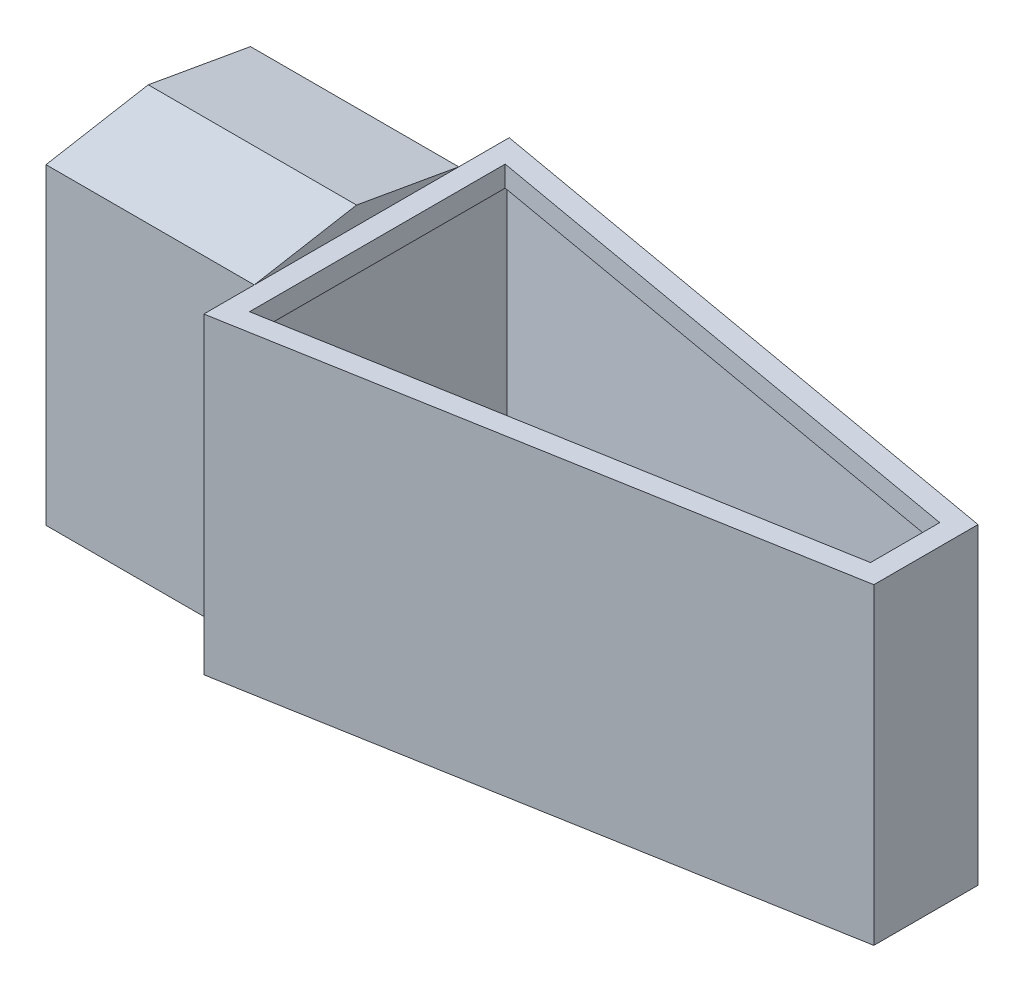
ISO-10303-21;
HEADER;
FILE_DESCRIPTION(('STEP AP214'),'2;1');
FILE_NAME('part.step','',(''),(''),'','','');
FILE_SCHEMA(('AUTOMOTIVE_DESIGN { 1 0 10303 214 1 1 1 1 }'));
ENDSEC;
DATA;
#1=APPLICATION_CONTEXT('core data for automotive mechanical design processes');
#2=APPLICATION_PROTOCOL_DEFINITION('international standard','automotive_design',2000,#1);
#3=PRODUCT_CONTEXT('',#1,'mechanical');
#4=PRODUCT('Part','Part','',(#3));
#5=PRODUCT_RELATED_PRODUCT_CATEGORY('part','',(#4));
#6=PRODUCT_DEFINITION_FORMATION('','',#4);
#7=PRODUCT_DEFINITION_CONTEXT('part definition',#1,'design');
#8=PRODUCT_DEFINITION('design','',#6,#7);
#9=PRODUCT_DEFINITION_SHAPE('','',#8);
#10=(LENGTH_UNIT() NAMED_UNIT(*) SI_UNIT(.MILLI.,.METRE.));
#11=(NAMED_UNIT(*) PLANE_ANGLE_UNIT() SI_UNIT($,.RADIAN.));
#12=(NAMED_UNIT(*) SI_UNIT($,.STERADIAN.) SOLID_ANGLE_UNIT());
#13=UNCERTAINTY_MEASURE_WITH_UNIT(LENGTH_MEASURE(1.E-05),#10,'distance_accuracy_value','');
#14=(GEOMETRIC_REPRESENTATION_CONTEXT(3) GLOBAL_UNCERTAINTY_ASSIGNED_CONTEXT((#13)) GLOBAL_UNIT_ASSIGNED_CONTEXT((#10,
#11,#12)) REPRESENTATION_CONTEXT('',''));
#15=CARTESIAN_POINT('',(0.,0.,0.));
#16=DIRECTION('',(0.,0.,1.));
#17=DIRECTION('',(1.,0.,0.));
#18=AXIS2_PLACEMENT_3D('',#15,#16,#17);
#19=CARTESIAN_POINT('',(12.8538089551144,38.1,-0.174987325087056));
#20=DIRECTION('',(1.,0.,0.));
#21=DIRECTION('',(0.,0.,-1.));
#22=AXIS2_PLACEMENT_3D('',#19,#20,#21);
#23=PLANE('',#22);
#24=DIRECTION('',(0.,-1.,0.));
#25=VECTOR('',#24,1.);
#26=CARTESIAN_POINT('',(12.8538089551144,0.,-31.26502256));
#27=LINE('',#26,#25);
#28=CARTESIAN_POINT('',(12.8538089551144,38.1,-31.26502256));
#29=VERTEX_POINT('',#28);
#30=CARTESIAN_POINT('',(12.8538089551144,0.,-31.2650225599999));
#31=VERTEX_POINT('',#30);
#32=EDGE_CURVE('E62',#29,#31,#27,.T.);
#33=ORIENTED_EDGE('',*,*,#32,.F.);
#34=DIRECTION('',(0.,0.,1.));
#35=VECTOR('',#34,1.);
#36=CARTESIAN_POINT('',(12.8538089551144,38.1,-0.174987325087056));
#37=LINE('',#36,#35);
#38=CARTESIAN_POINT('',(12.8538089551144,38.1,-37.417012674913));
#39=VERTEX_POINT('',#38);
#40=EDGE_CURVE('E395',#39,#29,#37,.T.);
#41=ORIENTED_EDGE('',*,*,#40,.F.);
#42=DIRECTION('',(0.,-1.,0.));
#43=VECTOR('',#42,1.);
#44=CARTESIAN_POINT('',(12.8538089551144,38.1,-37.417012674913));
#45=LINE('',#44,#43);
#46=CARTESIAN_POINT('',(12.8538089551144,0.,-37.417012674913));
#47=VERTEX_POINT('',#46);
#48=EDGE_CURVE('E12',#39,#47,#45,.T.);
#49=ORIENTED_EDGE('',*,*,#48,.T.);
#50=DIRECTION('',(0.,0.,1.));
#51=VECTOR('',#50,1.);
#52=CARTESIAN_POINT('',(12.8538089551144,0.,-0.174987325087056));
#53=LINE('',#52,#51);
#54=EDGE_CURVE('E407',#47,#31,#53,.T.);
#55=ORIENTED_EDGE('',*,*,#54,.T.);
#56=EDGE_LOOP('',(#33,#41,#49,#55));
#57=FACE_BOUND('',#56,.T.);
#58=ADVANCED_FACE('F39',(#57),#23,.F.);
#59=DIRECTION('',(0.,1.,0.));
#60=VECTOR('',#59,1.);
#61=CARTESIAN_POINT('',(12.8538089551144,0.,-6.32697744));
#62=LINE('',#61,#60);
#63=CARTESIAN_POINT('',(12.8538089551144,0.,-6.32697744));
#64=VERTEX_POINT('',#63);
#65=CARTESIAN_POINT('',(12.8538089551144,38.1,-6.32697744));
#66=VERTEX_POINT('',#65);
#67=EDGE_CURVE('E306',#64,#66,#62,.T.);
#68=ORIENTED_EDGE('',*,*,#67,.F.);
#69=CARTESIAN_POINT('',(12.8538089551144,0.,-0.174987325087056));
#70=VERTEX_POINT('',#69);
#71=EDGE_CURVE('E406',#64,#70,#53,.T.);
#72=ORIENTED_EDGE('',*,*,#71,.T.);
#73=DIRECTION('',(0.,-1.,0.));
#74=VECTOR('',#73,1.);
#75=CARTESIAN_POINT('',(12.8538089551144,38.1,-0.174987325087056));
#76=LINE('',#75,#74);
#77=CARTESIAN_POINT('',(12.8538089551144,38.1,-0.174987325087056));
#78=VERTEX_POINT('',#77);
#79=EDGE_CURVE('E47',#78,#70,#76,.T.);
#80=ORIENTED_EDGE('',*,*,#79,.F.);
#81=EDGE_CURVE('E393',#66,#78,#37,.T.);
#82=ORIENTED_EDGE('',*,*,#81,.F.);
#83=EDGE_LOOP('',(#68,#72,#80,#82));
#84=FACE_BOUND('',#83,.T.);
#85=ADVANCED_FACE('F446',(#84),#23,.F.);
#86=CARTESIAN_POINT('',(0.,38.1,0.));
#87=DIRECTION('',(0.,-1.,0.));
#88=DIRECTION('',(0.,0.,-1.));
#89=AXIS2_PLACEMENT_3D('',#86,#87,#88);
#90=PLANE('',#89);
#91=DIRECTION('',(-0.984743468318978,0.,-0.174012360489451));
#92=VECTOR('',#91,1.);
#93=CARTESIAN_POINT('',(82.2959999999999,38.1,-25.146));
#94=LINE('',#93,#92);
#95=CARTESIAN_POINT('',(82.2959999999999,38.1,-25.146));
#96=VERTEX_POINT('',#95);
#97=EDGE_CURVE('E390',#96,#39,#94,.T.);
#98=ORIENTED_EDGE('',*,*,#97,.T.);
#99=ORIENTED_EDGE('',*,*,#40,.T.);
#100=EDGE_CURVE('E399',#29,#66,#37,.T.);
#101=ORIENTED_EDGE('',*,*,#100,.T.);
#102=ORIENTED_EDGE('',*,*,#81,.T.);
#103=DIRECTION('',(0.984743468318978,0.,-0.17401236048945));
#104=VECTOR('',#103,1.);
#105=CARTESIAN_POINT('',(82.2959999999999,38.1,-12.446));
#106=LINE('',#105,#104);
#107=CARTESIAN_POINT('',(82.2959999999999,38.1,-12.446));
#108=VERTEX_POINT('',#107);
#109=EDGE_CURVE('E398',#78,#108,#106,.T.);
#110=ORIENTED_EDGE('',*,*,#109,.T.);
#111=DIRECTION('',(0.,0.,-1.));
#112=VECTOR('',#111,1.);
#113=CARTESIAN_POINT('',(82.2959999999999,38.1,-12.446));
#114=LINE('',#113,#112);
#115=EDGE_CURVE('E401',#108,#96,#114,.T.);
#116=ORIENTED_EDGE('',*,*,#115,.T.);
#117=EDGE_LOOP('',(#98,#99,#101,#102,#110,#116));
#118=FACE_BOUND('',#117,.T.);
#119=DIRECTION('',(0.,0.,-1.));
#120=VECTOR('',#119,1.);
#121=CARTESIAN_POINT('',(15.3938089551144,38.1,-34.3888215859853));
#122=LINE('',#121,#120);
#123=CARTESIAN_POINT('',(15.3938089551144,38.1,-3.20317841401467));
#124=VERTEX_POINT('',#123);
#125=CARTESIAN_POINT('',(15.3938089551144,38.1,-34.3888215859853));
#126=VERTEX_POINT('',#125);
#127=EDGE_CURVE('E362',#124,#126,#122,.T.);
#128=ORIENTED_EDGE('',*,*,#127,.T.);
#129=DIRECTION('',(0.984743468318978,0.,0.174012360489451));
#130=VECTOR('',#129,1.);
#131=CARTESIAN_POINT('',(79.7559999999999,38.1,-23.0154871589875));
#132=LINE('',#131,#130);
#133=CARTESIAN_POINT('',(79.7559999999999,38.1,-23.0154871589875));
#134=VERTEX_POINT('',#133);
#135=EDGE_CURVE('E358',#126,#134,#132,.T.);
#136=ORIENTED_EDGE('',*,*,#135,.T.);
#137=DIRECTION('',(0.,0.,1.));
#138=VECTOR('',#137,1.);
#139=CARTESIAN_POINT('',(79.7559999999999,38.1,-14.5765128410125));
#140=LINE('',#139,#138);
#141=CARTESIAN_POINT('',(79.7559999999999,38.1,-14.5765128410125));
#142=VERTEX_POINT('',#141);
#143=EDGE_CURVE('E361',#134,#142,#140,.T.);
#144=ORIENTED_EDGE('',*,*,#143,.T.);
#145=DIRECTION('',(-0.984743468318978,0.,0.17401236048945));
#146=VECTOR('',#145,1.);
#147=CARTESIAN_POINT('',(15.3938089551144,38.1,-3.20317841401467));
#148=LINE('',#147,#146);
#149=EDGE_CURVE('E365',#142,#124,#148,.T.);
#150=ORIENTED_EDGE('',*,*,#149,.T.);
#151=EDGE_LOOP('',(#128,#136,#144,#150));
#152=FACE_BOUND('',#151,.T.);
#153=ADVANCED_FACE('F442',(#118,#152),#90,.F.);
#154=CARTESIAN_POINT('',(82.2959999999999,38.1,-25.146));
#155=DIRECTION('',(-0.174012360489451,0.,0.984743468318978));
#156=DIRECTION('',(0.984743468318978,0.,0.174012360489451));
#157=AXIS2_PLACEMENT_3D('',#154,#155,#156);
#158=PLANE('',#157);
#159=DIRECTION('',(-0.984743468318978,0.,-0.174012360489451));
#160=VECTOR('',#159,1.);
#161=CARTESIAN_POINT('',(82.2959999999999,0.,-25.146));
#162=LINE('',#161,#160);
#163=CARTESIAN_POINT('',(82.2959999999999,0.,-25.146));
#164=VERTEX_POINT('',#163);
#165=EDGE_CURVE('E368',#164,#47,#162,.T.);
#166=ORIENTED_EDGE('',*,*,#165,.T.);
#167=ORIENTED_EDGE('',*,*,#48,.F.);
#168=ORIENTED_EDGE('',*,*,#97,.F.);
#169=DIRECTION('',(0.,-1.,0.));
#170=VECTOR('',#169,1.);
#171=CARTESIAN_POINT('',(82.2959999999999,38.1,-25.146));
#172=LINE('',#171,#170);
#173=EDGE_CURVE('E403',#96,#164,#172,.T.);
#174=ORIENTED_EDGE('',*,*,#173,.T.);
#175=EDGE_LOOP('',(#166,#167,#168,#174));
#176=FACE_BOUND('',#175,.T.);
#177=ADVANCED_FACE('F41',(#176),#158,.F.);
#178=EDGE_CURVE('E411',#31,#64,#53,.T.);
#179=ORIENTED_EDGE('',*,*,#178,.T.);
#180=DIRECTION('',(0.,0.173648177666934,-0.984807753012208));
#181=VECTOR('',#180,1.);
#182=CARTESIAN_POINT('',(12.8538089551144,-1.08197686542356,-0.19078171387655));
#183=LINE('',#182,#181);
#184=CARTESIAN_POINT('',(12.8538089551144,2.19862510039056,-18.7959999999999));
#185=VERTEX_POINT('',#184);
#186=EDGE_CURVE('E303',#64,#185,#183,.T.);
#187=ORIENTED_EDGE('',*,*,#186,.T.);
#188=DIRECTION('',(0.,-0.173648177666931,-0.984807753012208));
#189=VECTOR('',#188,1.);
#190=CARTESIAN_POINT('',(12.8538089551144,5.34663374852575,-0.942755785831534));
#191=LINE('',#190,#189);
#192=EDGE_CURVE('E300',#185,#31,#191,.T.);
#193=ORIENTED_EDGE('',*,*,#192,.T.);
#194=EDGE_LOOP('',(#179,#187,#193));
#195=FACE_BOUND('',#194,.T.);
#196=ADVANCED_FACE('F468',(#195),#23,.F.);
#197=CARTESIAN_POINT('',(82.2959999999999,38.1,-12.446));
#198=DIRECTION('',(-0.17401236048945,0.,-0.984743468318978));
#199=DIRECTION('',(-0.984743468318978,0.,0.17401236048945));
#200=AXIS2_PLACEMENT_3D('',#197,#198,#199);
#201=PLANE('',#200);
#202=DIRECTION('',(0.984743468318978,0.,-0.17401236048945));
#203=VECTOR('',#202,1.);
#204=CARTESIAN_POINT('',(82.2959999999999,0.,-12.446));
#205=LINE('',#204,#203);
#206=CARTESIAN_POINT('',(82.2959999999999,0.,-12.446));
#207=VERTEX_POINT('',#206);
#208=EDGE_CURVE('E410',#70,#207,#205,.T.);
#209=ORIENTED_EDGE('',*,*,#208,.T.);
#210=DIRECTION('',(0.,-1.,0.));
#211=VECTOR('',#210,1.);
#212=CARTESIAN_POINT('',(82.2959999999999,38.1,-12.446));
#213=LINE('',#212,#211);
#214=EDGE_CURVE('E416',#108,#207,#213,.T.);
#215=ORIENTED_EDGE('',*,*,#214,.F.);
#216=ORIENTED_EDGE('',*,*,#109,.F.);
#217=ORIENTED_EDGE('',*,*,#79,.T.);
#218=EDGE_LOOP('',(#209,#215,#216,#217));
#219=FACE_BOUND('',#218,.T.);
#220=ADVANCED_FACE('F423',(#219),#201,.F.);
#221=CARTESIAN_POINT('',(82.2959999999999,38.1,-12.446));
#222=DIRECTION('',(-1.,0.,0.));
#223=DIRECTION('',(0.,0.,1.));
#224=AXIS2_PLACEMENT_3D('',#221,#222,#223);
#225=PLANE('',#224);
#226=DIRECTION('',(0.,0.,-1.));
#227=VECTOR('',#226,1.);
#228=CARTESIAN_POINT('',(82.2959999999999,0.,-12.446));
#229=LINE('',#228,#227);
#230=EDGE_CURVE('E394',#207,#164,#229,.T.);
#231=ORIENTED_EDGE('',*,*,#230,.T.);
#232=ORIENTED_EDGE('',*,*,#173,.F.);
#233=ORIENTED_EDGE('',*,*,#115,.F.);
#234=ORIENTED_EDGE('',*,*,#214,.T.);
#235=EDGE_LOOP('',(#231,#232,#233,#234));
#236=FACE_BOUND('',#235,.T.);
#237=ADVANCED_FACE('F436',(#236),#225,.F.);
#238=CARTESIAN_POINT('',(0.,0.,0.));
#239=DIRECTION('',(0.,-1.,0.));
#240=DIRECTION('',(0.,0.,-1.));
#241=AXIS2_PLACEMENT_3D('',#238,#239,#240);
#242=PLANE('',#241);
#243=ORIENTED_EDGE('',*,*,#165,.F.);
#244=ORIENTED_EDGE('',*,*,#230,.F.);
#245=ORIENTED_EDGE('',*,*,#208,.F.);
#246=ORIENTED_EDGE('',*,*,#71,.F.);
#247=ORIENTED_EDGE('',*,*,#178,.F.);
#248=ORIENTED_EDGE('',*,*,#54,.F.);
#249=EDGE_LOOP('',(#243,#244,#245,#246,#247,#248));
#250=FACE_BOUND('',#249,.T.);
#251=ADVANCED_FACE('F431',(#250),#242,.T.);
#252=CARTESIAN_POINT('',(15.3938089551144,109.619479697127,-34.3888215859853));
#253=DIRECTION('',(1.,0.,0.));
#254=DIRECTION('',(0.,0.,-1.));
#255=AXIS2_PLACEMENT_3D('',#252,#253,#254);
#256=PLANE('',#255);
#257=DIRECTION('',(0.,-1.,0.));
#258=VECTOR('',#257,1.);
#259=CARTESIAN_POINT('',(15.3938089551144,109.619479697127,-3.20317841401467));
#260=LINE('',#259,#258);
#261=CARTESIAN_POINT('',(15.3938089551144,35.56,-3.20317841401467));
#262=VERTEX_POINT('',#261);
#263=EDGE_CURVE('E376',#124,#262,#260,.T.);
#264=ORIENTED_EDGE('',*,*,#263,.T.);
#265=DIRECTION('',(0.,0.,1.));
#266=VECTOR('',#265,1.);
#267=CARTESIAN_POINT('',(15.3938089551144,35.56,-34.3888215859853));
#268=LINE('',#267,#266);
#269=CARTESIAN_POINT('',(15.3938089551144,35.56,-34.3888215859853));
#270=VERTEX_POINT('',#269);
#271=EDGE_CURVE('E374',#270,#262,#268,.T.);
#272=ORIENTED_EDGE('',*,*,#271,.F.);
#273=DIRECTION('',(0.,-1.,0.));
#274=VECTOR('',#273,1.);
#275=CARTESIAN_POINT('',(15.3938089551144,109.619479697127,-34.3888215859853));
#276=LINE('',#275,#274);
#277=EDGE_CURVE('E379',#126,#270,#276,.T.);
#278=ORIENTED_EDGE('',*,*,#277,.F.);
#279=ORIENTED_EDGE('',*,*,#127,.F.);
#280=EDGE_LOOP('',(#264,#272,#278,#279));
#281=FACE_BOUND('',#280,.T.);
#282=ADVANCED_FACE('F509',(#281),#256,.T.);
#283=CARTESIAN_POINT('',(79.7559999999999,109.619479697127,-23.0154871589875));
#284=DIRECTION('',(-0.174012360489451,0.,0.984743468318978));
#285=DIRECTION('',(0.984743468318978,0.,0.174012360489451));
#286=AXIS2_PLACEMENT_3D('',#283,#284,#285);
#287=PLANE('',#286);
#288=ORIENTED_EDGE('',*,*,#277,.T.);
#289=DIRECTION('',(-0.984743468318978,0.,-0.174012360489451));
#290=VECTOR('',#289,1.);
#291=CARTESIAN_POINT('',(79.7559999999999,35.56,-23.0154871589875));
#292=LINE('',#291,#290);
#293=CARTESIAN_POINT('',(79.7559999999999,35.56,-23.0154871589875));
#294=VERTEX_POINT('',#293);
#295=EDGE_CURVE('E372',#294,#270,#292,.T.);
#296=ORIENTED_EDGE('',*,*,#295,.F.);
#297=DIRECTION('',(0.,-1.,0.));
#298=VECTOR('',#297,1.);
#299=CARTESIAN_POINT('',(79.7559999999999,109.619479697127,-23.0154871589875));
#300=LINE('',#299,#298);
#301=EDGE_CURVE('E382',#134,#294,#300,.T.);
#302=ORIENTED_EDGE('',*,*,#301,.F.);
#303=ORIENTED_EDGE('',*,*,#135,.F.);
#304=EDGE_LOOP('',(#288,#296,#302,#303));
#305=FACE_BOUND('',#304,.T.);
#306=ADVANCED_FACE('F529',(#305),#287,.T.);
#307=CARTESIAN_POINT('',(79.7559999999999,109.619479697127,-14.5765128410125));
#308=DIRECTION('',(-1.,0.,0.));
#309=DIRECTION('',(0.,0.,1.));
#310=AXIS2_PLACEMENT_3D('',#307,#308,#309);
#311=PLANE('',#310);
#312=ORIENTED_EDGE('',*,*,#301,.T.);
#313=DIRECTION('',(0.,0.,-1.));
#314=VECTOR('',#313,1.);
#315=CARTESIAN_POINT('',(79.7559999999999,35.56,-14.5765128410125));
#316=LINE('',#315,#314);
#317=CARTESIAN_POINT('',(79.7559999999999,35.56,-14.5765128410125));
#318=VERTEX_POINT('',#317);
#319=EDGE_CURVE('E370',#318,#294,#316,.T.);
#320=ORIENTED_EDGE('',*,*,#319,.F.);
#321=DIRECTION('',(0.,-1.,0.));
#322=VECTOR('',#321,1.);
#323=CARTESIAN_POINT('',(79.7559999999999,109.619479697127,-14.5765128410125));
#324=LINE('',#323,#322);
#325=EDGE_CURVE('E385',#142,#318,#324,.T.);
#326=ORIENTED_EDGE('',*,*,#325,.F.);
#327=ORIENTED_EDGE('',*,*,#143,.F.);
#328=EDGE_LOOP('',(#312,#320,#326,#327));
#329=FACE_BOUND('',#328,.T.);
#330=ADVANCED_FACE('F537',(#329),#311,.T.);
#331=CARTESIAN_POINT('',(15.3938089551144,109.619479697127,-3.20317841401467));
#332=DIRECTION('',(-0.17401236048945,0.,-0.984743468318978));
#333=DIRECTION('',(-0.984743468318978,0.,0.17401236048945));
#334=AXIS2_PLACEMENT_3D('',#331,#332,#333);
#335=PLANE('',#334);
#336=ORIENTED_EDGE('',*,*,#325,.T.);
#337=DIRECTION('',(0.984743468318978,0.,-0.17401236048945));
#338=VECTOR('',#337,1.);
#339=CARTESIAN_POINT('',(15.3938089551144,35.56,-3.20317841401467));
#340=LINE('',#339,#338);
#341=EDGE_CURVE('E357',#262,#318,#340,.T.);
#342=ORIENTED_EDGE('',*,*,#341,.F.);
#343=ORIENTED_EDGE('',*,*,#263,.F.);
#344=ORIENTED_EDGE('',*,*,#149,.F.);
#345=EDGE_LOOP('',(#336,#342,#343,#344));
#346=FACE_BOUND('',#345,.T.);
#347=ADVANCED_FACE('F506',(#346),#335,.T.);
#348=CARTESIAN_POINT('',(0.,1.27,0.));
#349=DIRECTION('',(0.,-1.,0.));
#350=DIRECTION('',(0.,0.,-1.));
#351=AXIS2_PLACEMENT_3D('',#348,#349,#350);
#352=PLANE('',#351);
#353=DIRECTION('',(0.984743468318978,0.,-0.17401236048945));
#354=VECTOR('',#353,1.);
#355=CARTESIAN_POINT('',(14.1238089551144,1.26999999999999,-1.68908286955086));
#356=LINE('',#355,#354);
#357=CARTESIAN_POINT('',(14.1238089551144,1.26999999999998,-1.68908286955086));
#358=VERTEX_POINT('',#357);
#359=CARTESIAN_POINT('',(81.0259999999999,1.26999999999998,-13.5112564205063));
#360=VERTEX_POINT('',#359);
#361=EDGE_CURVE('E341',#358,#360,#356,.T.);
#362=ORIENTED_EDGE('',*,*,#361,.T.);
#363=DIRECTION('',(0.,0.,-1.));
#364=VECTOR('',#363,1.);
#365=CARTESIAN_POINT('',(81.0259999999999,1.26999999999998,-13.5112564205063));
#366=LINE('',#365,#364);
#367=CARTESIAN_POINT('',(81.0259999999999,1.26999999999995,-24.0807435794937));
#368=VERTEX_POINT('',#367);
#369=EDGE_CURVE('E329',#360,#368,#366,.T.);
#370=ORIENTED_EDGE('',*,*,#369,.T.);
#371=DIRECTION('',(-0.984743468318978,0.,-0.174012360489451));
#372=VECTOR('',#371,1.);
#373=CARTESIAN_POINT('',(81.0259999999999,1.26999999999998,-24.0807435794937));
#374=LINE('',#373,#372);
#375=CARTESIAN_POINT('',(14.1238089551144,1.26999999999998,-35.9029171304491));
#376=VERTEX_POINT('',#375);
#377=EDGE_CURVE('E350',#368,#376,#374,.T.);
#378=ORIENTED_EDGE('',*,*,#377,.T.);
#379=DIRECTION('',(0.,0.,1.));
#380=VECTOR('',#379,1.);
#381=CARTESIAN_POINT('',(14.1238089551144,1.26999999999998,-35.9029171304491));
#382=LINE('',#381,#380);
#383=EDGE_CURVE('E346',#376,#358,#382,.T.);
#384=ORIENTED_EDGE('',*,*,#383,.T.);
#385=EDGE_LOOP('',(#362,#370,#378,#384));
#386=FACE_BOUND('',#385,.T.);
#387=ADVANCED_FACE('F551',(#386),#352,.F.);
#388=CARTESIAN_POINT('',(0.,35.56,0.));
#389=DIRECTION('',(0.,1.,0.));
#390=DIRECTION('',(0.,0.,1.));
#391=AXIS2_PLACEMENT_3D('',#388,#389,#390);
#392=PLANE('',#391);
#393=ORIENTED_EDGE('',*,*,#341,.T.);
#394=ORIENTED_EDGE('',*,*,#319,.T.);
#395=ORIENTED_EDGE('',*,*,#295,.T.);
#396=ORIENTED_EDGE('',*,*,#271,.T.);
#397=EDGE_LOOP('',(#393,#394,#395,#396));
#398=FACE_BOUND('',#397,.T.);
#399=DIRECTION('',(0.984743468318978,0.,-0.17401236048945));
#400=VECTOR('',#399,1.);
#401=CARTESIAN_POINT('',(14.1238089551144,35.56,-1.68908286955086));
#402=LINE('',#401,#400);
#403=CARTESIAN_POINT('',(14.1238089551144,35.56,-1.68908286955086));
#404=VERTEX_POINT('',#403);
#405=CARTESIAN_POINT('',(81.0259999999999,35.56,-13.5112564205063));
#406=VERTEX_POINT('',#405);
#407=EDGE_CURVE('E325',#404,#406,#402,.T.);
#408=ORIENTED_EDGE('',*,*,#407,.F.);
#409=DIRECTION('',(0.,0.,1.));
#410=VECTOR('',#409,1.);
#411=CARTESIAN_POINT('',(14.1238089551144,35.56,-35.9029171304491));
#412=LINE('',#411,#410);
#413=CARTESIAN_POINT('',(14.1238089551144,35.56,-35.9029171304491));
#414=VERTEX_POINT('',#413);
#415=EDGE_CURVE('E326',#414,#404,#412,.T.);
#416=ORIENTED_EDGE('',*,*,#415,.F.);
#417=DIRECTION('',(-0.984743468318978,0.,-0.174012360489451));
#418=VECTOR('',#417,1.);
#419=CARTESIAN_POINT('',(81.0259999999999,35.56,-24.0807435794937));
#420=LINE('',#419,#418);
#421=CARTESIAN_POINT('',(81.0259999999999,35.56,-24.0807435794937));
#422=VERTEX_POINT('',#421);
#423=EDGE_CURVE('E330',#422,#414,#420,.T.);
#424=ORIENTED_EDGE('',*,*,#423,.F.);
#425=DIRECTION('',(0.,0.,-1.));
#426=VECTOR('',#425,1.);
#427=CARTESIAN_POINT('',(81.0259999999999,35.56,-13.5112564205063));
#428=LINE('',#427,#426);
#429=EDGE_CURVE('E333',#406,#422,#428,.T.);
#430=ORIENTED_EDGE('',*,*,#429,.F.);
#431=EDGE_LOOP('',(#408,#416,#424,#430));
#432=FACE_BOUND('',#431,.T.);
#433=ADVANCED_FACE('F558',(#398,#432),#392,.F.);
#434=CARTESIAN_POINT('',(81.0259999999999,-75.1431275729097,-13.5112564205063));
#435=DIRECTION('',(1.,0.,0.));
#436=DIRECTION('',(0.,0.,-1.));
#437=AXIS2_PLACEMENT_3D('',#434,#435,#436);
#438=PLANE('',#437);
#439=DIRECTION('',(0.,1.,0.));
#440=VECTOR('',#439,1.);
#441=CARTESIAN_POINT('',(81.0259999999999,-75.1431275729097,-13.5112564205063));
#442=LINE('',#441,#440);
#443=EDGE_CURVE('E344',#360,#406,#442,.T.);
#444=ORIENTED_EDGE('',*,*,#443,.T.);
#445=ORIENTED_EDGE('',*,*,#429,.T.);
#446=DIRECTION('',(0.,1.,0.));
#447=VECTOR('',#446,1.);
#448=CARTESIAN_POINT('',(81.0259999999999,-75.1431275729097,-24.0807435794937));
#449=LINE('',#448,#447);
#450=EDGE_CURVE('E340',#368,#422,#449,.T.);
#451=ORIENTED_EDGE('',*,*,#450,.F.);
#452=ORIENTED_EDGE('',*,*,#369,.F.);
#453=EDGE_LOOP('',(#444,#445,#451,#452));
#454=FACE_BOUND('',#453,.T.);
#455=ADVANCED_FACE('F566',(#454),#438,.F.);
#456=CARTESIAN_POINT('',(81.0259999999999,-75.1431275729097,-24.0807435794937));
#457=DIRECTION('',(0.174012360489451,0.,-0.984743468318978));
#458=DIRECTION('',(-0.984743468318978,0.,-0.174012360489451));
#459=AXIS2_PLACEMENT_3D('',#456,#457,#458);
#460=PLANE('',#459);
#461=ORIENTED_EDGE('',*,*,#450,.T.);
#462=ORIENTED_EDGE('',*,*,#423,.T.);
#463=DIRECTION('',(0.,1.,0.));
#464=VECTOR('',#463,1.);
#465=CARTESIAN_POINT('',(14.1238089551144,-75.1431275729097,-35.9029171304491));
#466=LINE('',#465,#464);
#467=EDGE_CURVE('E349',#376,#414,#466,.T.);
#468=ORIENTED_EDGE('',*,*,#467,.F.);
#469=ORIENTED_EDGE('',*,*,#377,.F.);
#470=EDGE_LOOP('',(#461,#462,#468,#469));
#471=FACE_BOUND('',#470,.T.);
#472=ADVANCED_FACE('F574',(#471),#460,.F.);
#473=CARTESIAN_POINT('',(14.1238089551144,-75.1431275729097,-35.9029171304491));
#474=DIRECTION('',(-1.,0.,0.));
#475=DIRECTION('',(0.,0.,1.));
#476=AXIS2_PLACEMENT_3D('',#473,#474,#475);
#477=PLANE('',#476);
#478=ORIENTED_EDGE('',*,*,#467,.T.);
#479=ORIENTED_EDGE('',*,*,#415,.T.);
#480=DIRECTION('',(0.,1.,0.));
#481=VECTOR('',#480,1.);
#482=CARTESIAN_POINT('',(14.1238089551144,-75.1431275729097,-1.68908286955086));
#483=LINE('',#482,#481);
#484=EDGE_CURVE('E345',#358,#404,#483,.T.);
#485=ORIENTED_EDGE('',*,*,#484,.F.);
#486=ORIENTED_EDGE('',*,*,#383,.F.);
#487=EDGE_LOOP('',(#478,#479,#485,#486));
#488=FACE_BOUND('',#487,.T.);
#489=ADVANCED_FACE('F582',(#488),#477,.F.);
#490=CARTESIAN_POINT('',(14.1238089551144,-75.1431275729097,-1.68908286955086));
#491=DIRECTION('',(0.17401236048945,0.,0.984743468318978));
#492=DIRECTION('',(0.984743468318978,0.,-0.17401236048945));
#493=AXIS2_PLACEMENT_3D('',#490,#491,#492);
#494=PLANE('',#493);
#495=ORIENTED_EDGE('',*,*,#484,.T.);
#496=ORIENTED_EDGE('',*,*,#407,.T.);
#497=ORIENTED_EDGE('',*,*,#443,.F.);
#498=ORIENTED_EDGE('',*,*,#361,.F.);
#499=EDGE_LOOP('',(#495,#496,#497,#498));
#500=FACE_BOUND('',#499,.T.);
#501=ADVANCED_FACE('F590',(#500),#494,.F.);
#502=CARTESIAN_POINT('',(-12.5461910448856,0.,-31.26502256));
#503=DIRECTION('',(0.,0.,1.));
#504=DIRECTION('',(0.,-1.,0.));
#505=AXIS2_PLACEMENT_3D('',#502,#503,#504);
#506=PLANE('',#505);
#507=ORIENTED_EDGE('',*,*,#32,.T.);
#508=DIRECTION('',(1.,0.,0.));
#509=VECTOR('',#508,1.);
#510=CARTESIAN_POINT('',(-12.5461910448856,0.,-31.26502256));
#511=LINE('',#510,#509);
#512=CARTESIAN_POINT('',(-12.5461910448856,0.,-31.26502256));
#513=VERTEX_POINT('',#512);
#514=EDGE_CURVE('E323',#513,#31,#511,.T.);
#515=ORIENTED_EDGE('',*,*,#514,.F.);
#516=DIRECTION('',(0.,-1.,0.));
#517=VECTOR('',#516,1.);
#518=CARTESIAN_POINT('',(-12.5461910448856,0.,-31.26502256));
#519=LINE('',#518,#517);
#520=CARTESIAN_POINT('',(-12.5461910448856,38.1,-31.26502256));
#521=VERTEX_POINT('',#520);
#522=EDGE_CURVE('E283',#521,#513,#519,.T.);
#523=ORIENTED_EDGE('',*,*,#522,.F.);
#524=DIRECTION('',(1.,0.,0.));
#525=VECTOR('',#524,1.);
#526=CARTESIAN_POINT('',(-12.5461910448856,38.1,-31.26502256));
#527=LINE('',#526,#525);
#528=EDGE_CURVE('E298',#521,#29,#527,.T.);
#529=ORIENTED_EDGE('',*,*,#528,.T.);
#530=EDGE_LOOP('',(#507,#515,#523,#529));
#531=FACE_BOUND('',#530,.T.);
#532=ADVANCED_FACE('F465',(#531),#506,.F.);
#533=CARTESIAN_POINT('',(-12.5461910448856,5.34663374852575,-0.942755785831534));
#534=DIRECTION('',(0.,-0.984807753012208,0.173648177666931));
#535=DIRECTION('',(0.,-0.173648177666931,-0.984807753012208));
#536=AXIS2_PLACEMENT_3D('',#533,#534,#535);
#537=PLANE('',#536);
#538=ORIENTED_EDGE('',*,*,#192,.F.);
#539=DIRECTION('',(1.,0.,0.));
#540=VECTOR('',#539,1.);
#541=CARTESIAN_POINT('',(-12.5461910448856,2.19862510039056,-18.7959999999999));
#542=LINE('',#541,#540);
#543=CARTESIAN_POINT('',(-12.5461910448856,2.19862510039056,-18.7959999999999));
#544=VERTEX_POINT('',#543);
#545=EDGE_CURVE('E321',#544,#185,#542,.T.);
#546=ORIENTED_EDGE('',*,*,#545,.F.);
#547=DIRECTION('',(0.,-0.173648177666931,-0.984807753012208));
#548=VECTOR('',#547,1.);
#549=CARTESIAN_POINT('',(-12.5461910448856,5.34663374852575,-0.942755785831534));
#550=LINE('',#549,#548);
#551=EDGE_CURVE('E285',#544,#513,#550,.T.);
#552=ORIENTED_EDGE('',*,*,#551,.T.);
#553=ORIENTED_EDGE('',*,*,#514,.T.);
#554=EDGE_LOOP('',(#538,#546,#552,#553));
#555=FACE_BOUND('',#554,.T.);
#556=ADVANCED_FACE('F471',(#555),#537,.T.);
#557=CARTESIAN_POINT('',(-12.5461910448856,-1.08197686542356,-0.19078171387655));
#558=DIRECTION('',(0.,-0.984807753012207,-0.173648177666934));
#559=DIRECTION('',(0.,0.173648177666934,-0.984807753012207));
#560=AXIS2_PLACEMENT_3D('',#557,#558,#559);
#561=PLANE('',#560);
#562=ORIENTED_EDGE('',*,*,#186,.F.);
#563=DIRECTION('',(1.,0.,0.));
#564=VECTOR('',#563,1.);
#565=CARTESIAN_POINT('',(-12.5461910448856,0.,-6.32697744));
#566=LINE('',#565,#564);
#567=CARTESIAN_POINT('',(-12.5461910448856,0.,-6.32697744));
#568=VERTEX_POINT('',#567);
#569=EDGE_CURVE('E319',#568,#64,#566,.T.);
#570=ORIENTED_EDGE('',*,*,#569,.F.);
#571=DIRECTION('',(0.,0.173648177666934,-0.984807753012208));
#572=VECTOR('',#571,1.);
#573=CARTESIAN_POINT('',(-12.5461910448856,-1.08197686542356,-0.19078171387655));
#574=LINE('',#573,#572);
#575=EDGE_CURVE('E289',#568,#544,#574,.T.);
#576=ORIENTED_EDGE('',*,*,#575,.T.);
#577=ORIENTED_EDGE('',*,*,#545,.T.);
#578=EDGE_LOOP('',(#562,#570,#576,#577));
#579=FACE_BOUND('',#578,.T.);
#580=ADVANCED_FACE('F477',(#579),#561,.T.);
#581=CARTESIAN_POINT('',(-12.5461910448856,0.,-6.32697744));
#582=DIRECTION('',(0.,0.,-1.));
#583=DIRECTION('',(0.,1.,0.));
#584=AXIS2_PLACEMENT_3D('',#581,#582,#583);
#585=PLANE('',#584);
#586=ORIENTED_EDGE('',*,*,#67,.T.);
#587=DIRECTION('',(1.,0.,0.));
#588=VECTOR('',#587,1.);
#589=CARTESIAN_POINT('',(-12.5461910448856,38.1,-6.32697744));
#590=LINE('',#589,#588);
#591=CARTESIAN_POINT('',(-12.5461910448856,38.1,-6.32697744));
#592=VERTEX_POINT('',#591);
#593=EDGE_CURVE('E316',#592,#66,#590,.T.);
#594=ORIENTED_EDGE('',*,*,#593,.F.);
#595=DIRECTION('',(0.,1.,0.));
#596=VECTOR('',#595,1.);
#597=CARTESIAN_POINT('',(-12.5461910448856,0.,-6.32697744));
#598=LINE('',#597,#596);
#599=EDGE_CURVE('E292',#568,#592,#598,.T.);
#600=ORIENTED_EDGE('',*,*,#599,.F.);
#601=ORIENTED_EDGE('',*,*,#569,.T.);
#602=EDGE_LOOP('',(#586,#594,#600,#601));
#603=FACE_BOUND('',#602,.T.);
#604=ADVANCED_FACE('F449',(#603),#585,.F.);
#605=CARTESIAN_POINT('',(-12.5461910448856,35.8691675605479,6.32470201647762));
#606=DIRECTION('',(0.,-0.984807753012207,-0.173648177666935));
#607=DIRECTION('',(0.,0.173648177666935,-0.984807753012207));
#608=AXIS2_PLACEMENT_3D('',#605,#606,#607);
#609=PLANE('',#608);
#610=DIRECTION('',(0.,0.173648177666935,-0.984807753012207));
#611=VECTOR('',#610,1.);
#612=CARTESIAN_POINT('',(12.8538089551144,35.8691675605479,6.32470201647762));
#613=LINE('',#612,#611);
#614=CARTESIAN_POINT('',(12.8538089551144,40.2986251003906,-18.7959999999999));
#615=VERTEX_POINT('',#614);
#616=EDGE_CURVE('E308',#66,#615,#613,.T.);
#617=ORIENTED_EDGE('',*,*,#616,.T.);
#618=DIRECTION('',(1.,0.,0.));
#619=VECTOR('',#618,1.);
#620=CARTESIAN_POINT('',(-12.5461910448856,40.2986251003906,-18.7959999999999));
#621=LINE('',#620,#619);
#622=CARTESIAN_POINT('',(-12.5461910448856,40.2986251003906,-18.7959999999999));
#623=VERTEX_POINT('',#622);
#624=EDGE_CURVE('E313',#623,#615,#621,.T.);
#625=ORIENTED_EDGE('',*,*,#624,.F.);
#626=DIRECTION('',(0.,0.173648177666935,-0.984807753012207));
#627=VECTOR('',#626,1.);
#628=CARTESIAN_POINT('',(-12.5461910448856,35.8691675605479,6.32470201647762));
#629=LINE('',#628,#627);
#630=EDGE_CURVE('E294',#592,#623,#629,.T.);
#631=ORIENTED_EDGE('',*,*,#630,.F.);
#632=ORIENTED_EDGE('',*,*,#593,.T.);
#633=EDGE_LOOP('',(#617,#625,#631,#632));
#634=FACE_BOUND('',#633,.T.);
#635=ADVANCED_FACE('F455',(#634),#609,.F.);
#636=CARTESIAN_POINT('',(-12.5461910448856,42.2977781744973,-7.45823951618551));
#637=DIRECTION('',(0.,-0.984807753012208,0.17364817766693));
#638=DIRECTION('',(0.,-0.17364817766693,-0.984807753012208));
#639=AXIS2_PLACEMENT_3D('',#636,#637,#638);
#640=PLANE('',#639);
#641=DIRECTION('',(0.,-0.17364817766693,-0.984807753012208));
#642=VECTOR('',#641,1.);
#643=CARTESIAN_POINT('',(12.8538089551144,42.2977781744973,-7.45823951618551));
#644=LINE('',#643,#642);
#645=EDGE_CURVE('E286',#615,#29,#644,.T.);
#646=ORIENTED_EDGE('',*,*,#645,.T.);
#647=ORIENTED_EDGE('',*,*,#528,.F.);
#648=DIRECTION('',(0.,-0.17364817766693,-0.984807753012208));
#649=VECTOR('',#648,1.);
#650=CARTESIAN_POINT('',(-12.5461910448856,42.2977781744973,-7.45823951618551));
#651=LINE('',#650,#649);
#652=EDGE_CURVE('E296',#623,#521,#651,.T.);
#653=ORIENTED_EDGE('',*,*,#652,.F.);
#654=ORIENTED_EDGE('',*,*,#624,.T.);
#655=EDGE_LOOP('',(#646,#647,#653,#654));
#656=FACE_BOUND('',#655,.T.);
#657=ADVANCED_FACE('F462',(#656),#640,.F.);
#658=CARTESIAN_POINT('',(-12.5461910448856,0.,0.));
#659=DIRECTION('',(-1.,0.,0.));
#660=DIRECTION('',(0.,0.,1.));
#661=AXIS2_PLACEMENT_3D('',#658,#659,#660);
#662=PLANE('',#661);
#663=DIRECTION('',(0.,-1.,0.));
#664=VECTOR('',#663,1.);
#665=CARTESIAN_POINT('',(-12.5461910448856,0.,-28.72502256));
#666=LINE('',#665,#664);
#667=CARTESIAN_POINT('',(-12.5461910448856,35.9686869368097,-28.72502256));
#668=VERTEX_POINT('',#667);
#669=CARTESIAN_POINT('',(-12.5461910448856,3.02705412518928,-28.72502256));
#670=VERTEX_POINT('',#669);
#671=EDGE_CURVE('E257',#668,#670,#666,.T.);
#672=ORIENTED_EDGE('',*,*,#671,.F.);
#673=DIRECTION('',(0.,-0.17364817766693,-0.984807753012208));
#674=VECTOR('',#673,1.);
#675=CARTESIAN_POINT('',(-12.5461910448856,39.7963664818463,-7.01717314491151));
#676=LINE('',#675,#674);
#677=CARTESIAN_POINT('',(-12.5461910448856,37.7194415062008,-18.7959999999999));
#678=VERTEX_POINT('',#677);
#679=EDGE_CURVE('E269',#678,#668,#676,.T.);
#680=ORIENTED_EDGE('',*,*,#679,.F.);
#681=DIRECTION('',(0.,0.173648177666935,-0.984807753012207));
#682=VECTOR('',#681,1.);
#683=CARTESIAN_POINT('',(-12.5461910448856,33.3677558678969,5.8836356452036));
#684=LINE('',#683,#682);
#685=CARTESIAN_POINT('',(-12.5461910448856,35.9686869368097,-8.86697744));
#686=VERTEX_POINT('',#685);
#687=EDGE_CURVE('E267',#686,#678,#684,.T.);
#688=ORIENTED_EDGE('',*,*,#687,.F.);
#689=DIRECTION('',(0.,1.,0.));
#690=VECTOR('',#689,1.);
#691=CARTESIAN_POINT('',(-12.5461910448856,0.,-8.86697744));
#692=LINE('',#691,#690);
#693=CARTESIAN_POINT('',(-12.5461910448856,3.02705412518931,-8.86697744));
#694=VERTEX_POINT('',#693);
#695=EDGE_CURVE('E265',#694,#686,#692,.T.);
#696=ORIENTED_EDGE('',*,*,#695,.F.);
#697=DIRECTION('',(0.,0.173648177666934,-0.984807753012207));
#698=VECTOR('',#697,1.);
#699=CARTESIAN_POINT('',(-12.5461910448856,1.41943482722745,0.250284657397463));
#700=LINE('',#699,#698);
#701=CARTESIAN_POINT('',(-12.5461910448856,4.77780869458035,-18.7959999999999));
#702=VERTEX_POINT('',#701);
#703=EDGE_CURVE('E262',#694,#702,#700,.T.);
#704=ORIENTED_EDGE('',*,*,#703,.T.);
#705=DIRECTION('',(0.,-0.173648177666931,-0.984807753012208));
#706=VECTOR('',#705,1.);
#707=CARTESIAN_POINT('',(-12.5461910448856,7.84804544117676,-1.38382215710554));
#708=LINE('',#707,#706);
#709=EDGE_CURVE('E259',#702,#670,#708,.T.);
#710=ORIENTED_EDGE('',*,*,#709,.T.);
#711=EDGE_LOOP('',(#672,#680,#688,#696,#704,#710));
#712=FACE_BOUND('',#711,.T.);
#713=ORIENTED_EDGE('',*,*,#522,.T.);
#714=ORIENTED_EDGE('',*,*,#551,.F.);
#715=ORIENTED_EDGE('',*,*,#575,.F.);
#716=ORIENTED_EDGE('',*,*,#599,.T.);
#717=ORIENTED_EDGE('',*,*,#630,.T.);
#718=ORIENTED_EDGE('',*,*,#652,.T.);
#719=EDGE_LOOP('',(#713,#714,#715,#716,#717,#718));
#720=FACE_BOUND('',#719,.T.);
#721=ADVANCED_FACE('F475',(#712,#720),#662,.T.);
#722=CARTESIAN_POINT('',(12.8538089551144,0.,0.));
#723=DIRECTION('',(-1.,0.,0.));
#724=DIRECTION('',(0.,0.,1.));
#725=AXIS2_PLACEMENT_3D('',#722,#723,#724);
#726=PLANE('',#725);
#727=ORIENTED_EDGE('',*,*,#100,.F.);
#728=ORIENTED_EDGE('',*,*,#645,.F.);
#729=ORIENTED_EDGE('',*,*,#616,.F.);
#730=EDGE_LOOP('',(#727,#728,#729));
#731=FACE_BOUND('',#730,.T.);
#732=ADVANCED_FACE('F459',(#731),#726,.F.);
#733=CARTESIAN_POINT('',(11.5838089551144,-75.1431275729097,-35.9029171304491));
#734=DIRECTION('',(-1.,0.,0.));
#735=DIRECTION('',(0.,0.,1.));
#736=AXIS2_PLACEMENT_3D('',#733,#734,#735);
#737=PLANE('',#736);
#738=DIRECTION('',(0.,-0.173648177666934,0.984807753012208));
#739=VECTOR('',#738,1.);
#740=CARTESIAN_POINT('',(11.5838089551144,5.29335271367425,-21.7197954226995));
#741=LINE('',#740,#739);
#742=CARTESIAN_POINT('',(11.5838089551144,4.77780869458036,-18.7959999999999));
#743=VERTEX_POINT('',#742);
#744=CARTESIAN_POINT('',(11.5838089551144,3.0270541251893,-8.86697744));
#745=VERTEX_POINT('',#744);
#746=EDGE_CURVE('E280',#743,#745,#741,.T.);
#747=ORIENTED_EDGE('',*,*,#746,.T.);
#748=DIRECTION('',(0.,-1.,0.));
#749=VECTOR('',#748,1.);
#750=CARTESIAN_POINT('',(11.5838089551144,-75.1431275729097,-8.86697743999999));
#751=LINE('',#750,#749);
#752=CARTESIAN_POINT('',(11.5838089551144,35.56,-8.86697744000001));
#753=VERTEX_POINT('',#752);
#754=EDGE_CURVE('E275',#753,#745,#751,.T.);
#755=ORIENTED_EDGE('',*,*,#754,.F.);
#756=DIRECTION('',(0.,0.,1.));
#757=VECTOR('',#756,1.);
#758=CARTESIAN_POINT('',(11.5838089551144,35.56,-35.9029171304491));
#759=LINE('',#758,#757);
#760=CARTESIAN_POINT('',(11.5838089551144,35.56,-28.72502256));
#761=VERTEX_POINT('',#760);
#762=EDGE_CURVE('E221',#761,#753,#759,.T.);
#763=ORIENTED_EDGE('',*,*,#762,.F.);
#764=DIRECTION('',(0.,1.,0.));
#765=VECTOR('',#764,1.);
#766=CARTESIAN_POINT('',(11.5838089551144,-75.1431275729097,-28.72502256));
#767=LINE('',#766,#765);
#768=CARTESIAN_POINT('',(11.5838089551144,3.02705412518929,-28.72502256));
#769=VERTEX_POINT('',#768);
#770=EDGE_CURVE('E273',#769,#761,#767,.T.);
#771=ORIENTED_EDGE('',*,*,#770,.F.);
#772=DIRECTION('',(0.,0.173648177666931,0.984807753012208));
#773=VECTOR('',#772,1.);
#774=CARTESIAN_POINT('',(11.5838089551144,-0.557557535142375,-49.0543654996285));
#775=LINE('',#774,#773);
#776=EDGE_CURVE('E277',#769,#743,#775,.T.);
#777=ORIENTED_EDGE('',*,*,#776,.T.);
#778=EDGE_LOOP('',(#747,#755,#763,#771,#777));
#779=FACE_BOUND('',#778,.T.);
#780=ADVANCED_FACE('F654',(#779),#737,.T.);
#781=CARTESIAN_POINT('',(0.,35.56,0.));
#782=DIRECTION('',(0.,-1.,0.));
#783=DIRECTION('',(0.,0.,-1.));
#784=AXIS2_PLACEMENT_3D('',#781,#782,#783);
#785=PLANE('',#784);
#786=ORIENTED_EDGE('',*,*,#762,.T.);
#787=DIRECTION('',(-1.,0.,0.));
#788=VECTOR('',#787,1.);
#789=CARTESIAN_POINT('',(-12.5461910448856,35.56,-8.86697744));
#790=LINE('',#789,#788);
#791=CARTESIAN_POINT('',(10.3138089551144,35.56,-8.86697744));
#792=VERTEX_POINT('',#791);
#793=EDGE_CURVE('E215',#753,#792,#790,.T.);
#794=ORIENTED_EDGE('',*,*,#793,.T.);
#795=DIRECTION('',(0.,0.,1.));
#796=VECTOR('',#795,1.);
#797=CARTESIAN_POINT('',(10.3138089551144,35.56,0.));
#798=LINE('',#797,#796);
#799=CARTESIAN_POINT('',(10.3138089551144,35.56,-28.72502256));
#800=VERTEX_POINT('',#799);
#801=EDGE_CURVE('E219',#800,#792,#798,.T.);
#802=ORIENTED_EDGE('',*,*,#801,.F.);
#803=DIRECTION('',(-1.,0.,0.));
#804=VECTOR('',#803,1.);
#805=CARTESIAN_POINT('',(0.,35.56,-28.72502256));
#806=LINE('',#805,#804);
#807=EDGE_CURVE('E245',#761,#800,#806,.T.);
#808=ORIENTED_EDGE('',*,*,#807,.F.);
#809=EDGE_LOOP('',(#786,#794,#802,#808));
#810=FACE_BOUND('',#809,.T.);
#811=ADVANCED_FACE('F217',(#810),#785,.T.);
#812=CARTESIAN_POINT('',(-12.5461910448856,0.,-28.72502256));
#813=DIRECTION('',(0.,0.,1.));
#814=DIRECTION('',(0.,-1.,0.));
#815=AXIS2_PLACEMENT_3D('',#812,#813,#814);
#816=PLANE('',#815);
#817=ORIENTED_EDGE('',*,*,#770,.T.);
#818=ORIENTED_EDGE('',*,*,#807,.T.);
#819=DIRECTION('',(0.,-1.,0.));
#820=VECTOR('',#819,1.);
#821=CARTESIAN_POINT('',(10.3138089551144,0.,-28.72502256));
#822=LINE('',#821,#820);
#823=CARTESIAN_POINT('',(10.3138089551144,35.9686869368097,-28.72502256));
#824=VERTEX_POINT('',#823);
#825=EDGE_CURVE('E225',#824,#800,#822,.T.);
#826=ORIENTED_EDGE('',*,*,#825,.F.);
#827=DIRECTION('',(1.,0.,0.));
#828=VECTOR('',#827,1.);
#829=CARTESIAN_POINT('',(-12.5461910448856,35.9686869368097,-28.72502256));
#830=LINE('',#829,#828);
#831=EDGE_CURVE('E271',#668,#824,#830,.T.);
#832=ORIENTED_EDGE('',*,*,#831,.F.);
#833=ORIENTED_EDGE('',*,*,#671,.T.);
#834=DIRECTION('',(1.,0.,0.));
#835=VECTOR('',#834,1.);
#836=CARTESIAN_POINT('',(-12.5461910448856,3.02705412518928,-28.72502256));
#837=LINE('',#836,#835);
#838=EDGE_CURVE('E233',#670,#769,#837,.T.);
#839=ORIENTED_EDGE('',*,*,#838,.T.);
#840=EDGE_LOOP('',(#817,#818,#826,#832,#833,#839));
#841=FACE_BOUND('',#840,.T.);
#842=ADVANCED_FACE('F678',(#841),#816,.T.);
#843=CARTESIAN_POINT('',(-12.5461910448856,7.84804544117676,-1.38382215710554));
#844=DIRECTION('',(0.,-0.984807753012208,0.173648177666931));
#845=DIRECTION('',(0.,-0.173648177666931,-0.984807753012208));
#846=AXIS2_PLACEMENT_3D('',#843,#844,#845);
#847=PLANE('',#846);
#848=ORIENTED_EDGE('',*,*,#838,.F.);
#849=ORIENTED_EDGE('',*,*,#709,.F.);
#850=DIRECTION('',(1.,0.,0.));
#851=VECTOR('',#850,1.);
#852=CARTESIAN_POINT('',(-12.5461910448856,4.77780869458035,-18.7959999999999));
#853=LINE('',#852,#851);
#854=EDGE_CURVE('E249',#702,#743,#853,.T.);
#855=ORIENTED_EDGE('',*,*,#854,.T.);
#856=ORIENTED_EDGE('',*,*,#776,.F.);
#857=EDGE_LOOP('',(#848,#849,#855,#856));
#858=FACE_BOUND('',#857,.T.);
#859=ADVANCED_FACE('F685',(#858),#847,.F.);
#860=CARTESIAN_POINT('',(-12.5461910448856,1.41943482722745,0.250284657397463));
#861=DIRECTION('',(0.,-0.984807753012207,-0.173648177666934));
#862=DIRECTION('',(0.,0.173648177666934,-0.984807753012207));
#863=AXIS2_PLACEMENT_3D('',#860,#861,#862);
#864=PLANE('',#863);
#865=ORIENTED_EDGE('',*,*,#854,.F.);
#866=ORIENTED_EDGE('',*,*,#703,.F.);
#867=DIRECTION('',(1.,0.,0.));
#868=VECTOR('',#867,1.);
#869=CARTESIAN_POINT('',(-12.5461910448856,3.02705412518931,-8.86697744));
#870=LINE('',#869,#868);
#871=EDGE_CURVE('E252',#694,#745,#870,.T.);
#872=ORIENTED_EDGE('',*,*,#871,.T.);
#873=ORIENTED_EDGE('',*,*,#746,.F.);
#874=EDGE_LOOP('',(#865,#866,#872,#873));
#875=FACE_BOUND('',#874,.T.);
#876=ADVANCED_FACE('F694',(#875),#864,.F.);
#877=CARTESIAN_POINT('',(-12.5461910448856,0.,-8.86697744));
#878=DIRECTION('',(0.,0.,-1.));
#879=DIRECTION('',(0.,1.,0.));
#880=AXIS2_PLACEMENT_3D('',#877,#878,#879);
#881=PLANE('',#880);
#882=ORIENTED_EDGE('',*,*,#754,.T.);
#883=ORIENTED_EDGE('',*,*,#871,.F.);
#884=ORIENTED_EDGE('',*,*,#695,.T.);
#885=DIRECTION('',(1.,0.,0.));
#886=VECTOR('',#885,1.);
#887=CARTESIAN_POINT('',(-12.5461910448856,35.9686869368097,-8.86697744));
#888=LINE('',#887,#886);
#889=CARTESIAN_POINT('',(10.3138089551144,35.9686869368097,-8.86697744));
#890=VERTEX_POINT('',#889);
#891=EDGE_CURVE('E237',#686,#890,#888,.T.);
#892=ORIENTED_EDGE('',*,*,#891,.T.);
#893=DIRECTION('',(0.,-1.,0.));
#894=VECTOR('',#893,1.);
#895=CARTESIAN_POINT('',(10.3138089551144,0.,-8.86697744));
#896=LINE('',#895,#894);
#897=EDGE_CURVE('E226',#890,#792,#896,.T.);
#898=ORIENTED_EDGE('',*,*,#897,.T.);
#899=ORIENTED_EDGE('',*,*,#793,.F.);
#900=EDGE_LOOP('',(#882,#883,#884,#892,#898,#899));
#901=FACE_BOUND('',#900,.T.);
#902=ADVANCED_FACE('F235',(#901),#881,.T.);
#903=CARTESIAN_POINT('',(-12.5461910448856,33.3677558678969,5.8836356452036));
#904=DIRECTION('',(0.,-0.984807753012207,-0.173648177666935));
#905=DIRECTION('',(0.,0.173648177666935,-0.984807753012207));
#906=AXIS2_PLACEMENT_3D('',#903,#904,#905);
#907=PLANE('',#906);
#908=DIRECTION('',(0.,0.173648177666935,-0.984807753012207));
#909=VECTOR('',#908,1.);
#910=CARTESIAN_POINT('',(10.3138089551144,33.3677558678969,5.8836356452036));
#911=LINE('',#910,#909);
#912=CARTESIAN_POINT('',(10.3138089551144,37.7194415062008,-18.7959999999999));
#913=VERTEX_POINT('',#912);
#914=EDGE_CURVE('E779',#890,#913,#911,.T.);
#915=ORIENTED_EDGE('',*,*,#914,.F.);
#916=ORIENTED_EDGE('',*,*,#891,.F.);
#917=ORIENTED_EDGE('',*,*,#687,.T.);
#918=DIRECTION('',(1.,0.,0.));
#919=VECTOR('',#918,1.);
#920=CARTESIAN_POINT('',(-12.5461910448856,37.7194415062008,-18.7959999999999));
#921=LINE('',#920,#919);
#922=EDGE_CURVE('E54',#678,#913,#921,.T.);
#923=ORIENTED_EDGE('',*,*,#922,.T.);
#924=EDGE_LOOP('',(#915,#916,#917,#923));
#925=FACE_BOUND('',#924,.T.);
#926=ADVANCED_FACE('F711',(#925),#907,.T.);
#927=CARTESIAN_POINT('',(-12.5461910448856,39.7963664818463,-7.01717314491151));
#928=DIRECTION('',(0.,-0.984807753012208,0.17364817766693));
#929=DIRECTION('',(0.,-0.17364817766693,-0.984807753012208));
#930=AXIS2_PLACEMENT_3D('',#927,#928,#929);
#931=PLANE('',#930);
#932=DIRECTION('',(0.,-0.17364817766693,-0.984807753012208));
#933=VECTOR('',#932,1.);
#934=CARTESIAN_POINT('',(10.3138089551144,39.7963664818463,-7.01717314491151));
#935=LINE('',#934,#933);
#936=EDGE_CURVE('E241',#913,#824,#935,.T.);
#937=ORIENTED_EDGE('',*,*,#936,.F.);
#938=ORIENTED_EDGE('',*,*,#922,.F.);
#939=ORIENTED_EDGE('',*,*,#679,.T.);
#940=ORIENTED_EDGE('',*,*,#831,.T.);
#941=EDGE_LOOP('',(#937,#938,#939,#940));
#942=FACE_BOUND('',#941,.T.);
#943=ADVANCED_FACE('F719',(#942),#931,.T.);
#944=CARTESIAN_POINT('',(10.3138089551144,0.,0.));
#945=DIRECTION('',(-1.,0.,0.));
#946=DIRECTION('',(0.,0.,1.));
#947=AXIS2_PLACEMENT_3D('',#944,#945,#946);
#948=PLANE('',#947);
#949=ORIENTED_EDGE('',*,*,#801,.T.);
#950=ORIENTED_EDGE('',*,*,#897,.F.);
#951=ORIENTED_EDGE('',*,*,#914,.T.);
#952=ORIENTED_EDGE('',*,*,#936,.T.);
#953=ORIENTED_EDGE('',*,*,#825,.T.);
#954=EDGE_LOOP('',(#949,#950,#951,#952,#953));
#955=FACE_BOUND('',#954,.T.);
#956=ADVANCED_FACE('F230',(#955),#948,.T.);
#957=CLOSED_SHELL('',(#58,#85,#153,#177,#196,#220,#237,#251,#282,#306,#330,#347,#387,#433,#455,
#472,#489,#501,#532,#556,#580,#604,#635,#657,#721,#732,#780,#811,#842,#859,#876,#902,#926,#943,#956));
#958=MANIFOLD_SOLID_BREP('B2',#957);
#959=ADVANCED_BREP_SHAPE_REPRESENTATION('',(#18,#958),#14);
#960=SHAPE_DEFINITION_REPRESENTATION(#9,#959);
ENDSEC;
END-ISO-10303-21;
